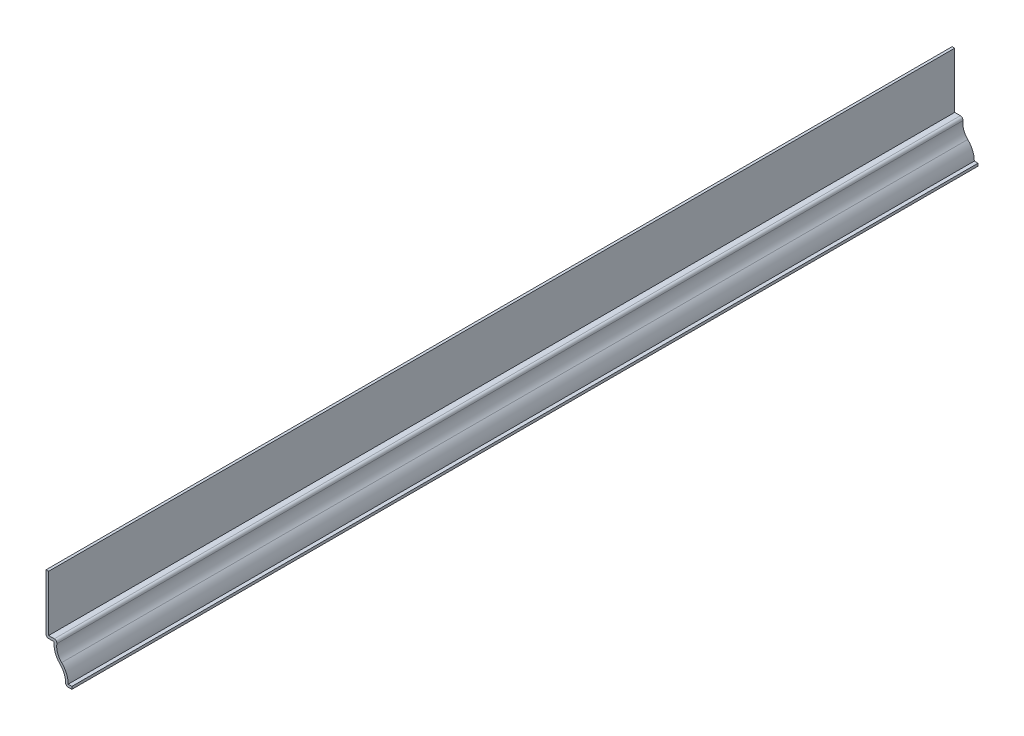
ISO-10303-21;
HEADER;
FILE_DESCRIPTION(('STEP AP214'),'2;1');
FILE_NAME('part.step','',(''),(''),'','','');
FILE_SCHEMA(('AUTOMOTIVE_DESIGN { 1 0 10303 214 1 1 1 1 }'));
ENDSEC;
DATA;
#1=APPLICATION_CONTEXT('core data for automotive mechanical design processes');
#2=APPLICATION_PROTOCOL_DEFINITION('international standard','automotive_design',2000,#1);
#3=PRODUCT_CONTEXT('',#1,'mechanical');
#4=PRODUCT('Part','Part','',(#3));
#5=PRODUCT_RELATED_PRODUCT_CATEGORY('part','',(#4));
#6=PRODUCT_DEFINITION_FORMATION('','',#4);
#7=PRODUCT_DEFINITION_CONTEXT('part definition',#1,'design');
#8=PRODUCT_DEFINITION('design','',#6,#7);
#9=PRODUCT_DEFINITION_SHAPE('','',#8);
#10=(LENGTH_UNIT() NAMED_UNIT(*) SI_UNIT(.MILLI.,.METRE.));
#11=(NAMED_UNIT(*) PLANE_ANGLE_UNIT() SI_UNIT($,.RADIAN.));
#12=(NAMED_UNIT(*) SI_UNIT($,.STERADIAN.) SOLID_ANGLE_UNIT());
#13=UNCERTAINTY_MEASURE_WITH_UNIT(LENGTH_MEASURE(1.E-05),#10,'distance_accuracy_value','');
#14=(GEOMETRIC_REPRESENTATION_CONTEXT(3) GLOBAL_UNCERTAINTY_ASSIGNED_CONTEXT((#13)) GLOBAL_UNIT_ASSIGNED_CONTEXT((#10,
#11,#12)) REPRESENTATION_CONTEXT('',''));
#15=CARTESIAN_POINT('',(0.,0.,0.));
#16=DIRECTION('',(0.,0.,1.));
#17=DIRECTION('',(1.,0.,0.));
#18=AXIS2_PLACEMENT_3D('',#15,#16,#17);
#19=CARTESIAN_POINT('',(-11.43,15.875,-444.5));
#20=DIRECTION('',(1.,0.,0.));
#21=DIRECTION('',(0.,0.,-1.));
#22=AXIS2_PLACEMENT_3D('',#19,#20,#21);
#23=PLANE('',#22);
#24=DIRECTION('',(0.,1.,0.));
#25=VECTOR('',#24,1.);
#26=CARTESIAN_POINT('',(-11.43,15.875,0.));
#27=LINE('',#26,#25);
#28=CARTESIAN_POINT('',(-11.43,17.145,0.));
#29=VERTEX_POINT('',#28);
#30=CARTESIAN_POINT('',(-11.43,44.45,0.));
#31=VERTEX_POINT('',#30);
#32=EDGE_CURVE('E194',#29,#31,#27,.T.);
#33=ORIENTED_EDGE('',*,*,#32,.F.);
#34=DIRECTION('',(0.,0.,1.));
#35=VECTOR('',#34,1.);
#36=CARTESIAN_POINT('',(-11.43,17.145,-444.5));
#37=LINE('',#36,#35);
#38=CARTESIAN_POINT('',(-11.43,17.145,-444.5));
#39=VERTEX_POINT('',#38);
#40=EDGE_CURVE('E167',#39,#29,#37,.T.);
#41=ORIENTED_EDGE('',*,*,#40,.F.);
#42=DIRECTION('',(0.,1.,0.));
#43=VECTOR('',#42,1.);
#44=CARTESIAN_POINT('',(-11.43,15.875,-444.5));
#45=LINE('',#44,#43);
#46=CARTESIAN_POINT('',(-11.43,44.45,-444.5));
#47=VERTEX_POINT('',#46);
#48=EDGE_CURVE('E148',#39,#47,#45,.T.);
#49=ORIENTED_EDGE('',*,*,#48,.T.);
#50=DIRECTION('',(0.,0.,1.));
#51=VECTOR('',#50,1.);
#52=CARTESIAN_POINT('',(-11.43,44.45,-444.5));
#53=LINE('',#52,#51);
#54=EDGE_CURVE('E155',#47,#31,#53,.T.);
#55=ORIENTED_EDGE('',*,*,#54,.T.);
#56=EDGE_LOOP('',(#33,#41,#49,#55));
#57=FACE_BOUND('',#56,.T.);
#58=ADVANCED_FACE('F35',(#57),#23,.T.);
#59=CARTESIAN_POINT('',(-8.64401507522455,17.145,-444.5));
#60=DIRECTION('',(0.,1.,0.));
#61=DIRECTION('',(0.,0.,1.));
#62=AXIS2_PLACEMENT_3D('',#59,#60,#61);
#63=PLANE('',#62);
#64=DIRECTION('',(1.,0.,0.));
#65=VECTOR('',#64,1.);
#66=CARTESIAN_POINT('',(-8.64401507522455,17.145,0.));
#67=LINE('',#66,#65);
#68=CARTESIAN_POINT('',(-8.64401507522455,17.145,0.));
#69=VERTEX_POINT('',#68);
#70=EDGE_CURVE('E168',#69,#29,#67,.F.);
#71=ORIENTED_EDGE('',*,*,#70,.F.);
#72=DIRECTION('',(0.,0.,1.));
#73=VECTOR('',#72,1.);
#74=CARTESIAN_POINT('',(-8.64401507522455,17.145,-444.5));
#75=LINE('',#74,#73);
#76=CARTESIAN_POINT('',(-8.64401507522455,17.145,-444.5));
#77=VERTEX_POINT('',#76);
#78=EDGE_CURVE('E11',#69,#77,#75,.F.);
#79=ORIENTED_EDGE('',*,*,#78,.T.);
#80=DIRECTION('',(1.,0.,0.));
#81=VECTOR('',#80,1.);
#82=CARTESIAN_POINT('',(-8.64401507522455,17.145,-444.5));
#83=LINE('',#82,#81);
#84=EDGE_CURVE('E163',#77,#39,#83,.F.);
#85=ORIENTED_EDGE('',*,*,#84,.T.);
#86=ORIENTED_EDGE('',*,*,#40,.T.);
#87=EDGE_LOOP('',(#71,#79,#85,#86));
#88=FACE_BOUND('',#87,.T.);
#89=ADVANCED_FACE('F275',(#88),#63,.T.);
#90=CARTESIAN_POINT('',(0.55694470110086,14.605,-444.5));
#91=DIRECTION('',(0.,0.,1.));
#92=DIRECTION('',(1.,0.,0.));
#93=AXIS2_PLACEMENT_3D('',#90,#91,#92);
#94=CYLINDRICAL_SURFACE('',#93,8.01819470110086);
#95=CARTESIAN_POINT('',(0.55694470110086,14.605,-444.5));
#96=DIRECTION('',(0.,0.,1.));
#97=DIRECTION('',(1.,0.,0.));
#98=AXIS2_PLACEMENT_3D('',#95,#96,#97);
#99=CIRCLE('',#98,8.01819470110086);
#100=CARTESIAN_POINT('',(-5.02533202154645,8.84916532060276,-444.5));
#101=VERTEX_POINT('',#100);
#102=CARTESIAN_POINT('',(-7.3859429425906,15.7013494627423,-444.5));
#103=VERTEX_POINT('',#102);
#104=EDGE_CURVE('E190',#101,#103,#99,.F.);
#105=ORIENTED_EDGE('',*,*,#104,.T.);
#106=DIRECTION('',(0.,0.,1.));
#107=VECTOR('',#106,1.);
#108=CARTESIAN_POINT('',(-7.3859429425906,15.7013494627423,-444.5));
#109=LINE('',#108,#107);
#110=CARTESIAN_POINT('',(-7.3859429425906,15.7013494627423,0.));
#111=VERTEX_POINT('',#110);
#112=EDGE_CURVE('E43',#103,#111,#109,.T.);
#113=ORIENTED_EDGE('',*,*,#112,.T.);
#114=CARTESIAN_POINT('',(0.55694470110086,14.605,0.));
#115=DIRECTION('',(0.,0.,1.));
#116=DIRECTION('',(1.,0.,0.));
#117=AXIS2_PLACEMENT_3D('',#114,#115,#116);
#118=CIRCLE('',#117,8.01819470110086);
#119=CARTESIAN_POINT('',(-5.02533202154645,8.84916532060276,0.));
#120=VERTEX_POINT('',#119);
#121=EDGE_CURVE('E170',#120,#111,#118,.F.);
#122=ORIENTED_EDGE('',*,*,#121,.F.);
#123=DIRECTION('',(0.,0.,1.));
#124=VECTOR('',#123,1.);
#125=CARTESIAN_POINT('',(-5.02533202154645,8.84916532060276,-444.5));
#126=LINE('',#125,#124);
#127=EDGE_CURVE('E220',#101,#120,#126,.T.);
#128=ORIENTED_EDGE('',*,*,#127,.F.);
#129=EDGE_LOOP('',(#105,#113,#122,#128));
#130=FACE_BOUND('',#129,.T.);
#131=ADVANCED_FACE('F258',(#130),#94,.F.);
#132=CARTESIAN_POINT('',(-12.3759597763254,1.27,-444.5));
#133=DIRECTION('',(0.,0.,1.));
#134=DIRECTION('',(1.,0.,0.));
#135=AXIS2_PLACEMENT_3D('',#132,#133,#134);
#136=CYLINDRICAL_SURFACE('',#135,10.5581947011009);
#137=CARTESIAN_POINT('',(-12.3759597763254,1.27,0.));
#138=DIRECTION('',(0.,0.,1.));
#139=DIRECTION('',(1.,0.,0.));
#140=AXIS2_PLACEMENT_3D('',#137,#138,#139);
#141=CIRCLE('',#140,10.5581947011009);
#142=CARTESIAN_POINT('',(-1.81776507522455,1.27,0.));
#143=VERTEX_POINT('',#142);
#144=EDGE_CURVE('E213',#143,#120,#141,.T.);
#145=ORIENTED_EDGE('',*,*,#144,.F.);
#146=DIRECTION('',(0.,0.,1.));
#147=VECTOR('',#146,1.);
#148=CARTESIAN_POINT('',(-1.81776507522455,1.27,-444.5));
#149=LINE('',#148,#147);
#150=CARTESIAN_POINT('',(-1.81776507522455,1.27,-444.5));
#151=VERTEX_POINT('',#150);
#152=EDGE_CURVE('E222',#151,#143,#149,.T.);
#153=ORIENTED_EDGE('',*,*,#152,.F.);
#154=CARTESIAN_POINT('',(-12.3759597763254,1.27,-444.5));
#155=DIRECTION('',(0.,0.,1.));
#156=DIRECTION('',(1.,0.,0.));
#157=AXIS2_PLACEMENT_3D('',#154,#155,#156);
#158=CIRCLE('',#157,10.5581947011009);
#159=EDGE_CURVE('E187',#151,#101,#158,.T.);
#160=ORIENTED_EDGE('',*,*,#159,.T.);
#161=ORIENTED_EDGE('',*,*,#127,.T.);
#162=EDGE_LOOP('',(#145,#153,#160,#161));
#163=FACE_BOUND('',#162,.T.);
#164=ADVANCED_FACE('F270',(#163),#136,.T.);
#165=CARTESIAN_POINT('',(0.,1.27,-444.5));
#166=DIRECTION('',(0.,1.,0.));
#167=DIRECTION('',(-1.,0.,0.));
#168=AXIS2_PLACEMENT_3D('',#165,#166,#167);
#169=PLANE('',#168);
#170=DIRECTION('',(-1.,0.,0.));
#171=VECTOR('',#170,1.);
#172=CARTESIAN_POINT('',(0.,1.27,0.));
#173=LINE('',#172,#171);
#174=CARTESIAN_POINT('',(0.,1.27,0.));
#175=VERTEX_POINT('',#174);
#176=EDGE_CURVE('E210',#175,#143,#173,.T.);
#177=ORIENTED_EDGE('',*,*,#176,.F.);
#178=DIRECTION('',(0.,0.,1.));
#179=VECTOR('',#178,1.);
#180=CARTESIAN_POINT('',(0.,1.27,-444.5));
#181=LINE('',#180,#179);
#182=CARTESIAN_POINT('',(0.,1.27,-444.5));
#183=VERTEX_POINT('',#182);
#184=EDGE_CURVE('E224',#183,#175,#181,.T.);
#185=ORIENTED_EDGE('',*,*,#184,.F.);
#186=DIRECTION('',(-1.,0.,0.));
#187=VECTOR('',#186,1.);
#188=CARTESIAN_POINT('',(0.,1.27,-444.5));
#189=LINE('',#188,#187);
#190=EDGE_CURVE('E184',#183,#151,#189,.T.);
#191=ORIENTED_EDGE('',*,*,#190,.T.);
#192=ORIENTED_EDGE('',*,*,#152,.T.);
#193=EDGE_LOOP('',(#177,#185,#191,#192));
#194=FACE_BOUND('',#193,.T.);
#195=ADVANCED_FACE('F320',(#194),#169,.T.);
#196=CARTESIAN_POINT('',(0.,1.27,-444.5));
#197=DIRECTION('',(-1.,0.,0.));
#198=DIRECTION('',(0.,-1.,0.));
#199=AXIS2_PLACEMENT_3D('',#196,#197,#198);
#200=PLANE('',#199);
#201=DIRECTION('',(0.,-1.,0.));
#202=VECTOR('',#201,1.);
#203=CARTESIAN_POINT('',(0.,1.27,0.));
#204=LINE('',#203,#202);
#205=CARTESIAN_POINT('',(0.,0.,0.));
#206=VERTEX_POINT('',#205);
#207=EDGE_CURVE('E208',#175,#206,#204,.T.);
#208=ORIENTED_EDGE('',*,*,#207,.T.);
#209=DIRECTION('',(0.,0.,1.));
#210=VECTOR('',#209,1.);
#211=CARTESIAN_POINT('',(0.,0.,-444.5));
#212=LINE('',#211,#210);
#213=CARTESIAN_POINT('',(0.,0.,-444.5));
#214=VERTEX_POINT('',#213);
#215=EDGE_CURVE('E226',#214,#206,#212,.T.);
#216=ORIENTED_EDGE('',*,*,#215,.F.);
#217=DIRECTION('',(0.,-1.,0.));
#218=VECTOR('',#217,1.);
#219=CARTESIAN_POINT('',(0.,1.27,-444.5));
#220=LINE('',#219,#218);
#221=EDGE_CURVE('E182',#183,#214,#220,.T.);
#222=ORIENTED_EDGE('',*,*,#221,.F.);
#223=ORIENTED_EDGE('',*,*,#184,.T.);
#224=EDGE_LOOP('',(#208,#216,#222,#223));
#225=FACE_BOUND('',#224,.T.);
#226=ADVANCED_FACE('F316',(#225),#200,.F.);
#227=CARTESIAN_POINT('',(0.,0.,-444.5));
#228=DIRECTION('',(0.,1.,0.));
#229=DIRECTION('',(-1.,0.,0.));
#230=AXIS2_PLACEMENT_3D('',#227,#228,#229);
#231=PLANE('',#230);
#232=DIRECTION('',(-1.,0.,0.));
#233=VECTOR('',#232,1.);
#234=CARTESIAN_POINT('',(0.,0.,0.));
#235=LINE('',#234,#233);
#236=CARTESIAN_POINT('',(-1.81776507522455,0.,0.));
#237=VERTEX_POINT('',#236);
#238=EDGE_CURVE('E205',#206,#237,#235,.T.);
#239=ORIENTED_EDGE('',*,*,#238,.T.);
#240=DIRECTION('',(0.,0.,1.));
#241=VECTOR('',#240,1.);
#242=CARTESIAN_POINT('',(-1.81776507522455,0.,-444.5));
#243=LINE('',#242,#241);
#244=CARTESIAN_POINT('',(-1.81776507522455,0.,-444.5));
#245=VERTEX_POINT('',#244);
#246=EDGE_CURVE('E244',#237,#245,#243,.F.);
#247=ORIENTED_EDGE('',*,*,#246,.T.);
#248=DIRECTION('',(-1.,0.,0.));
#249=VECTOR('',#248,1.);
#250=CARTESIAN_POINT('',(0.,0.,-444.5));
#251=LINE('',#250,#249);
#252=EDGE_CURVE('E180',#214,#245,#251,.T.);
#253=ORIENTED_EDGE('',*,*,#252,.F.);
#254=ORIENTED_EDGE('',*,*,#215,.T.);
#255=EDGE_LOOP('',(#239,#247,#253,#254));
#256=FACE_BOUND('',#255,.T.);
#257=ADVANCED_FACE('F312',(#256),#231,.F.);
#258=CARTESIAN_POINT('',(-12.3759597763254,1.27,-444.5));
#259=DIRECTION('',(0.,0.,1.));
#260=DIRECTION('',(1.,0.,0.));
#261=AXIS2_PLACEMENT_3D('',#258,#259,#260);
#262=CYLINDRICAL_SURFACE('',#261,9.28819470110085);
#263=CARTESIAN_POINT('',(-12.3759597763254,1.27,-444.5));
#264=DIRECTION('',(0.,0.,1.));
#265=DIRECTION('',(1.,0.,0.));
#266=AXIS2_PLACEMENT_3D('',#263,#264,#265);
#267=CIRCLE('',#266,9.28819470110085);
#268=CARTESIAN_POINT('',(-3.08776507522455,1.27,-444.5));
#269=VERTEX_POINT('',#268);
#270=CARTESIAN_POINT('',(-5.90950753761227,7.9375,-444.5));
#271=VERTEX_POINT('',#270);
#272=EDGE_CURVE('E178',#269,#271,#267,.T.);
#273=ORIENTED_EDGE('',*,*,#272,.F.);
#274=DIRECTION('',(0.,0.,1.));
#275=VECTOR('',#274,1.);
#276=CARTESIAN_POINT('',(-3.08776507522455,1.27,-444.5));
#277=LINE('',#276,#275);
#278=CARTESIAN_POINT('',(-3.08776507522455,1.27,0.));
#279=VERTEX_POINT('',#278);
#280=EDGE_CURVE('E219',#269,#279,#277,.T.);
#281=ORIENTED_EDGE('',*,*,#280,.T.);
#282=CARTESIAN_POINT('',(-12.3759597763254,1.27,0.));
#283=DIRECTION('',(0.,0.,1.));
#284=DIRECTION('',(1.,0.,0.));
#285=AXIS2_PLACEMENT_3D('',#282,#283,#284);
#286=CIRCLE('',#285,9.28819470110085);
#287=CARTESIAN_POINT('',(-5.90950753761227,7.9375,0.));
#288=VERTEX_POINT('',#287);
#289=EDGE_CURVE('E203',#279,#288,#286,.T.);
#290=ORIENTED_EDGE('',*,*,#289,.T.);
#291=DIRECTION('',(0.,0.,1.));
#292=VECTOR('',#291,1.);
#293=CARTESIAN_POINT('',(-5.90950753761227,7.9375,-444.5));
#294=LINE('',#293,#292);
#295=EDGE_CURVE('E229',#271,#288,#294,.T.);
#296=ORIENTED_EDGE('',*,*,#295,.F.);
#297=EDGE_LOOP('',(#273,#281,#290,#296));
#298=FACE_BOUND('',#297,.T.);
#299=ADVANCED_FACE('F308',(#298),#262,.F.);
#300=CARTESIAN_POINT('',(0.55694470110086,14.605,-444.5));
#301=DIRECTION('',(0.,0.,1.));
#302=DIRECTION('',(1.,0.,0.));
#303=AXIS2_PLACEMENT_3D('',#300,#301,#302);
#304=CYLINDRICAL_SURFACE('',#303,9.28819470110086);
#305=CARTESIAN_POINT('',(0.55694470110086,14.605,0.));
#306=DIRECTION('',(0.,0.,-1.));
#307=DIRECTION('',(-1.,0.,0.));
#308=AXIS2_PLACEMENT_3D('',#305,#306,#307);
#309=CIRCLE('',#308,9.28819470110086);
#310=CARTESIAN_POINT('',(-8.64401507522455,15.875,0.));
#311=VERTEX_POINT('',#310);
#312=EDGE_CURVE('E201',#288,#311,#309,.T.);
#313=ORIENTED_EDGE('',*,*,#312,.T.);
#314=DIRECTION('',(0.,0.,1.));
#315=VECTOR('',#314,1.);
#316=CARTESIAN_POINT('',(-8.64401507522455,15.875,-444.5));
#317=LINE('',#316,#315);
#318=CARTESIAN_POINT('',(-8.64401507522455,15.875,-444.5));
#319=VERTEX_POINT('',#318);
#320=EDGE_CURVE('E232',#319,#311,#317,.T.);
#321=ORIENTED_EDGE('',*,*,#320,.F.);
#322=CARTESIAN_POINT('',(0.55694470110086,14.605,-444.5));
#323=DIRECTION('',(0.,0.,-1.));
#324=DIRECTION('',(-1.,0.,0.));
#325=AXIS2_PLACEMENT_3D('',#322,#323,#324);
#326=CIRCLE('',#325,9.28819470110086);
#327=EDGE_CURVE('E176',#271,#319,#326,.T.);
#328=ORIENTED_EDGE('',*,*,#327,.F.);
#329=ORIENTED_EDGE('',*,*,#295,.T.);
#330=EDGE_LOOP('',(#313,#321,#328,#329));
#331=FACE_BOUND('',#330,.T.);
#332=ADVANCED_FACE('F305',(#331),#304,.T.);
#333=CARTESIAN_POINT('',(-8.64401507522455,15.875,-444.5));
#334=DIRECTION('',(0.,1.,0.));
#335=DIRECTION('',(0.,0.,1.));
#336=AXIS2_PLACEMENT_3D('',#333,#334,#335);
#337=PLANE('',#336);
#338=DIRECTION('',(-1.,0.,0.));
#339=VECTOR('',#338,1.);
#340=CARTESIAN_POINT('',(-8.64401507522455,15.875,0.));
#341=LINE('',#340,#339);
#342=CARTESIAN_POINT('',(-11.43,15.875,0.));
#343=VERTEX_POINT('',#342);
#344=EDGE_CURVE('E199',#311,#343,#341,.T.);
#345=ORIENTED_EDGE('',*,*,#344,.T.);
#346=DIRECTION('',(0.,0.,1.));
#347=VECTOR('',#346,1.);
#348=CARTESIAN_POINT('',(-11.43,15.875,-444.5));
#349=LINE('',#348,#347);
#350=CARTESIAN_POINT('',(-11.43,15.875,-444.5));
#351=VERTEX_POINT('',#350);
#352=EDGE_CURVE('E58',#343,#351,#349,.F.);
#353=ORIENTED_EDGE('',*,*,#352,.T.);
#354=DIRECTION('',(-1.,0.,0.));
#355=VECTOR('',#354,1.);
#356=CARTESIAN_POINT('',(-8.64401507522455,15.875,-444.5));
#357=LINE('',#356,#355);
#358=EDGE_CURVE('E174',#319,#351,#357,.T.);
#359=ORIENTED_EDGE('',*,*,#358,.F.);
#360=ORIENTED_EDGE('',*,*,#320,.T.);
#361=EDGE_LOOP('',(#345,#353,#359,#360));
#362=FACE_BOUND('',#361,.T.);
#363=ADVANCED_FACE('F302',(#362),#337,.F.);
#364=CARTESIAN_POINT('',(-12.7,15.875,-444.5));
#365=DIRECTION('',(1.,0.,0.));
#366=DIRECTION('',(0.,0.,-1.));
#367=AXIS2_PLACEMENT_3D('',#364,#365,#366);
#368=PLANE('',#367);
#369=DIRECTION('',(0.,1.,0.));
#370=VECTOR('',#369,1.);
#371=CARTESIAN_POINT('',(-12.7,15.875,-444.5));
#372=LINE('',#371,#370);
#373=CARTESIAN_POINT('',(-12.7,17.145,-444.5));
#374=VERTEX_POINT('',#373);
#375=CARTESIAN_POINT('',(-12.7,44.45,-444.5));
#376=VERTEX_POINT('',#375);
#377=EDGE_CURVE('E149',#374,#376,#372,.T.);
#378=ORIENTED_EDGE('',*,*,#377,.F.);
#379=DIRECTION('',(0.,0.,1.));
#380=VECTOR('',#379,1.);
#381=CARTESIAN_POINT('',(-12.7,17.145,-444.5));
#382=LINE('',#381,#380);
#383=CARTESIAN_POINT('',(-12.7,17.145,0.));
#384=VERTEX_POINT('',#383);
#385=EDGE_CURVE('E251',#374,#384,#382,.T.);
#386=ORIENTED_EDGE('',*,*,#385,.T.);
#387=DIRECTION('',(0.,1.,0.));
#388=VECTOR('',#387,1.);
#389=CARTESIAN_POINT('',(-12.7,15.875,0.));
#390=LINE('',#389,#388);
#391=CARTESIAN_POINT('',(-12.7,44.45,0.));
#392=VERTEX_POINT('',#391);
#393=EDGE_CURVE('E197',#384,#392,#390,.T.);
#394=ORIENTED_EDGE('',*,*,#393,.T.);
#395=DIRECTION('',(0.,0.,1.));
#396=VECTOR('',#395,1.);
#397=CARTESIAN_POINT('',(-12.7,44.45,-444.5));
#398=LINE('',#397,#396);
#399=EDGE_CURVE('E162',#376,#392,#398,.T.);
#400=ORIENTED_EDGE('',*,*,#399,.F.);
#401=EDGE_LOOP('',(#378,#386,#394,#400));
#402=FACE_BOUND('',#401,.T.);
#403=ADVANCED_FACE('F279',(#402),#368,.F.);
#404=CARTESIAN_POINT('',(-12.7,44.45,-444.5));
#405=DIRECTION('',(0.,-1.,0.));
#406=DIRECTION('',(0.,0.,-1.));
#407=AXIS2_PLACEMENT_3D('',#404,#405,#406);
#408=PLANE('',#407);
#409=DIRECTION('',(1.,0.,0.));
#410=VECTOR('',#409,1.);
#411=CARTESIAN_POINT('',(-12.7,44.45,0.));
#412=LINE('',#411,#410);
#413=EDGE_CURVE('E158',#392,#31,#412,.T.);
#414=ORIENTED_EDGE('',*,*,#413,.T.);
#415=ORIENTED_EDGE('',*,*,#54,.F.);
#416=DIRECTION('',(1.,0.,0.));
#417=VECTOR('',#416,1.);
#418=CARTESIAN_POINT('',(-12.7,44.45,-444.5));
#419=LINE('',#418,#417);
#420=EDGE_CURVE('E142',#376,#47,#419,.T.);
#421=ORIENTED_EDGE('',*,*,#420,.F.);
#422=ORIENTED_EDGE('',*,*,#399,.T.);
#423=EDGE_LOOP('',(#414,#415,#421,#422));
#424=FACE_BOUND('',#423,.T.);
#425=ADVANCED_FACE('F156',(#424),#408,.F.);
#426=CARTESIAN_POINT('',(0.55694470110086,14.605,-444.5));
#427=DIRECTION('',(0.,0.,-1.));
#428=DIRECTION('',(-1.,0.,0.));
#429=AXIS2_PLACEMENT_3D('',#426,#427,#428);
#430=PLANE('',#429);
#431=ORIENTED_EDGE('',*,*,#252,.T.);
#432=CARTESIAN_POINT('',(-1.81776507522455,1.27,-444.5));
#433=DIRECTION('',(0.,0.,-1.));
#434=DIRECTION('',(-1.,0.,0.));
#435=AXIS2_PLACEMENT_3D('',#432,#433,#434);
#436=CIRCLE('',#435,1.27);
#437=EDGE_CURVE('E249',#245,#269,#436,.T.);
#438=ORIENTED_EDGE('',*,*,#437,.T.);
#439=ORIENTED_EDGE('',*,*,#272,.T.);
#440=ORIENTED_EDGE('',*,*,#327,.T.);
#441=ORIENTED_EDGE('',*,*,#358,.T.);
#442=CARTESIAN_POINT('',(-11.43,17.145,-444.5));
#443=DIRECTION('',(0.,0.,-1.));
#444=DIRECTION('',(-1.,0.,0.));
#445=AXIS2_PLACEMENT_3D('',#442,#443,#444);
#446=CIRCLE('',#445,1.27);
#447=EDGE_CURVE('E50',#351,#374,#446,.T.);
#448=ORIENTED_EDGE('',*,*,#447,.T.);
#449=ORIENTED_EDGE('',*,*,#377,.T.);
#450=ORIENTED_EDGE('',*,*,#420,.T.);
#451=ORIENTED_EDGE('',*,*,#48,.F.);
#452=ORIENTED_EDGE('',*,*,#84,.F.);
#453=CARTESIAN_POINT('',(-8.64401507522455,15.875,-444.5));
#454=DIRECTION('',(0.,0.,-1.));
#455=DIRECTION('',(-1.,0.,0.));
#456=AXIS2_PLACEMENT_3D('',#453,#454,#455);
#457=CIRCLE('',#456,1.27);
#458=EDGE_CURVE('E246',#77,#103,#457,.T.);
#459=ORIENTED_EDGE('',*,*,#458,.T.);
#460=ORIENTED_EDGE('',*,*,#104,.F.);
#461=ORIENTED_EDGE('',*,*,#159,.F.);
#462=ORIENTED_EDGE('',*,*,#190,.F.);
#463=ORIENTED_EDGE('',*,*,#221,.T.);
#464=EDGE_LOOP('',(#431,#438,#439,#440,#441,#448,#449,#450,#451,#452,#459,#460,#461,#462,#463));
#465=FACE_BOUND('',#464,.T.);
#466=ADVANCED_FACE('F145',(#465),#430,.T.);
#467=CARTESIAN_POINT('',(0.55694470110086,14.605,0.));
#468=DIRECTION('',(0.,0.,-1.));
#469=DIRECTION('',(-1.,0.,0.));
#470=AXIS2_PLACEMENT_3D('',#467,#468,#469);
#471=PLANE('',#470);
#472=ORIENTED_EDGE('',*,*,#289,.F.);
#473=CARTESIAN_POINT('',(-1.81776507522455,1.27,0.));
#474=DIRECTION('',(0.,0.,-1.));
#475=DIRECTION('',(-1.,0.,0.));
#476=AXIS2_PLACEMENT_3D('',#473,#474,#475);
#477=CIRCLE('',#476,1.27);
#478=EDGE_CURVE('E242',#279,#237,#477,.F.);
#479=ORIENTED_EDGE('',*,*,#478,.T.);
#480=ORIENTED_EDGE('',*,*,#238,.F.);
#481=ORIENTED_EDGE('',*,*,#207,.F.);
#482=ORIENTED_EDGE('',*,*,#176,.T.);
#483=ORIENTED_EDGE('',*,*,#144,.T.);
#484=ORIENTED_EDGE('',*,*,#121,.T.);
#485=CARTESIAN_POINT('',(-8.64401507522455,15.875,0.));
#486=DIRECTION('',(0.,0.,-1.));
#487=DIRECTION('',(-1.,0.,0.));
#488=AXIS2_PLACEMENT_3D('',#485,#486,#487);
#489=CIRCLE('',#488,1.27);
#490=EDGE_CURVE('E238',#111,#69,#489,.F.);
#491=ORIENTED_EDGE('',*,*,#490,.T.);
#492=ORIENTED_EDGE('',*,*,#70,.T.);
#493=ORIENTED_EDGE('',*,*,#32,.T.);
#494=ORIENTED_EDGE('',*,*,#413,.F.);
#495=ORIENTED_EDGE('',*,*,#393,.F.);
#496=CARTESIAN_POINT('',(-11.43,17.145,0.));
#497=DIRECTION('',(0.,0.,-1.));
#498=DIRECTION('',(-1.,0.,0.));
#499=AXIS2_PLACEMENT_3D('',#496,#497,#498);
#500=CIRCLE('',#499,1.27);
#501=EDGE_CURVE('E240',#384,#343,#500,.F.);
#502=ORIENTED_EDGE('',*,*,#501,.T.);
#503=ORIENTED_EDGE('',*,*,#344,.F.);
#504=ORIENTED_EDGE('',*,*,#312,.F.);
#505=EDGE_LOOP('',(#472,#479,#480,#481,#482,#483,#484,#491,#492,#493,#494,#495,#502,#503,#504));
#506=FACE_BOUND('',#505,.T.);
#507=ADVANCED_FACE('F264',(#506),#471,.F.);
#508=CARTESIAN_POINT('',(-1.81776507522455,1.27,-444.5));
#509=DIRECTION('',(0.,0.,1.));
#510=DIRECTION('',(1.,0.,0.));
#511=AXIS2_PLACEMENT_3D('',#508,#509,#510);
#512=CYLINDRICAL_SURFACE('',#511,1.27);
#513=ORIENTED_EDGE('',*,*,#437,.F.);
#514=ORIENTED_EDGE('',*,*,#246,.F.);
#515=ORIENTED_EDGE('',*,*,#478,.F.);
#516=ORIENTED_EDGE('',*,*,#280,.F.);
#517=EDGE_LOOP('',(#513,#514,#515,#516));
#518=FACE_BOUND('',#517,.T.);
#519=ADVANCED_FACE('F284',(#518),#512,.T.);
#520=CARTESIAN_POINT('',(-11.43,17.145,-444.5));
#521=DIRECTION('',(0.,0.,1.));
#522=DIRECTION('',(1.,0.,0.));
#523=AXIS2_PLACEMENT_3D('',#520,#521,#522);
#524=CYLINDRICAL_SURFACE('',#523,1.27);
#525=ORIENTED_EDGE('',*,*,#447,.F.);
#526=ORIENTED_EDGE('',*,*,#352,.F.);
#527=ORIENTED_EDGE('',*,*,#501,.F.);
#528=ORIENTED_EDGE('',*,*,#385,.F.);
#529=EDGE_LOOP('',(#525,#526,#527,#528));
#530=FACE_BOUND('',#529,.T.);
#531=ADVANCED_FACE('F282',(#530),#524,.T.);
#532=CARTESIAN_POINT('',(-8.64401507522455,15.875,-444.5));
#533=DIRECTION('',(0.,0.,1.));
#534=DIRECTION('',(1.,0.,0.));
#535=AXIS2_PLACEMENT_3D('',#532,#533,#534);
#536=CYLINDRICAL_SURFACE('',#535,1.27);
#537=ORIENTED_EDGE('',*,*,#458,.F.);
#538=ORIENTED_EDGE('',*,*,#78,.F.);
#539=ORIENTED_EDGE('',*,*,#490,.F.);
#540=ORIENTED_EDGE('',*,*,#112,.F.);
#541=EDGE_LOOP('',(#537,#538,#539,#540));
#542=FACE_BOUND('',#541,.T.);
#543=ADVANCED_FACE('F37',(#542),#536,.T.);
#544=CLOSED_SHELL('',(#58,#89,#131,#164,#195,#226,#257,#299,#332,#363,#403,#425,#466,#507,#519,
#531,#543));
#545=MANIFOLD_SOLID_BREP('B2',#544);
#546=ADVANCED_BREP_SHAPE_REPRESENTATION('',(#18,#545),#14);
#547=SHAPE_DEFINITION_REPRESENTATION(#9,#546);
ENDSEC;
END-ISO-10303-21;
